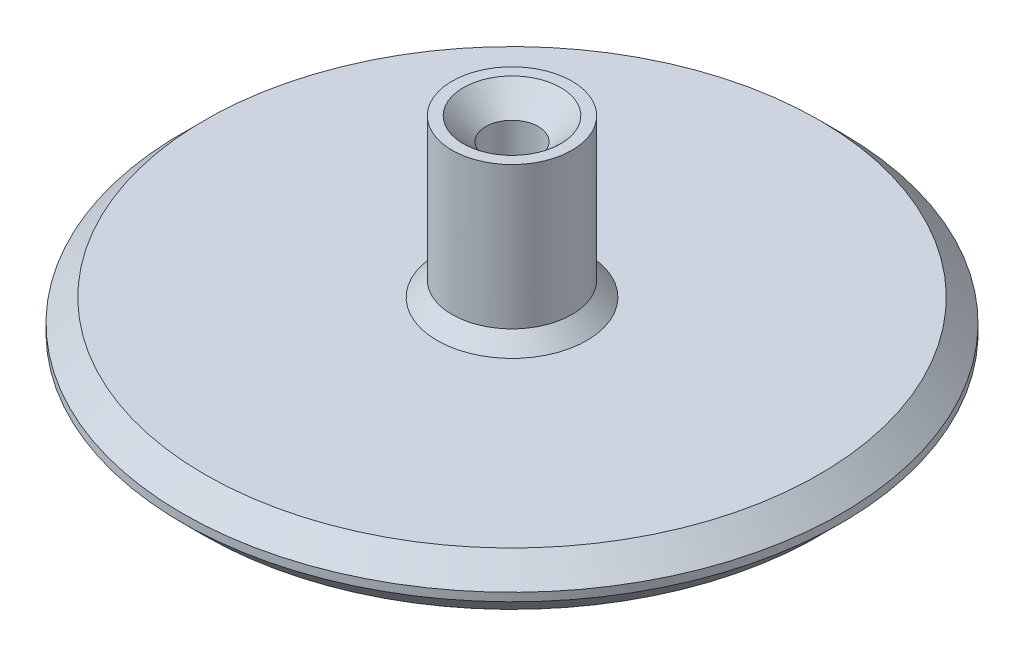
ISO-10303-21;
HEADER;
FILE_DESCRIPTION(('STEP AP214'),'2;1');
FILE_NAME('part.step','',(''),(''),'','','');
FILE_SCHEMA(('AUTOMOTIVE_DESIGN { 1 0 10303 214 1 1 1 1 }'));
ENDSEC;
DATA;
#1=APPLICATION_CONTEXT('core data for automotive mechanical design processes');
#2=APPLICATION_PROTOCOL_DEFINITION('international standard','automotive_design',2000,#1);
#3=PRODUCT_CONTEXT('',#1,'mechanical');
#4=PRODUCT('Part','Part','',(#3));
#5=PRODUCT_RELATED_PRODUCT_CATEGORY('part','',(#4));
#6=PRODUCT_DEFINITION_FORMATION('','',#4);
#7=PRODUCT_DEFINITION_CONTEXT('part definition',#1,'design');
#8=PRODUCT_DEFINITION('design','',#6,#7);
#9=PRODUCT_DEFINITION_SHAPE('','',#8);
#10=(LENGTH_UNIT() NAMED_UNIT(*) SI_UNIT(.MILLI.,.METRE.));
#11=(NAMED_UNIT(*) PLANE_ANGLE_UNIT() SI_UNIT($,.RADIAN.));
#12=(NAMED_UNIT(*) SI_UNIT($,.STERADIAN.) SOLID_ANGLE_UNIT());
#13=UNCERTAINTY_MEASURE_WITH_UNIT(LENGTH_MEASURE(1.E-05),#10,'distance_accuracy_value','');
#14=(GEOMETRIC_REPRESENTATION_CONTEXT(3) GLOBAL_UNCERTAINTY_ASSIGNED_CONTEXT((#13)) GLOBAL_UNIT_ASSIGNED_CONTEXT((#10,
#11,#12)) REPRESENTATION_CONTEXT('',''));
#15=CARTESIAN_POINT('',(0.,0.,0.));
#16=DIRECTION('',(0.,0.,1.));
#17=DIRECTION('',(1.,0.,0.));
#18=AXIS2_PLACEMENT_3D('',#15,#16,#17);
#19=CARTESIAN_POINT('',(0.,0.,0.));
#20=DIRECTION('',(0.,-1.,0.));
#21=DIRECTION('',(0.,0.,-1.));
#22=AXIS2_PLACEMENT_3D('',#19,#20,#21);
#23=CYLINDRICAL_SURFACE('',#22,1.75);
#24=CARTESIAN_POINT('',(0.,12.55,0.));
#25=DIRECTION('',(0.,-1.,0.));
#26=DIRECTION('',(0.,0.,-1.));
#27=AXIS2_PLACEMENT_3D('',#24,#25,#26);
#28=CIRCLE('',#27,1.75);
#29=CARTESIAN_POINT('',(0.,12.55,-1.75));
#30=VERTEX_POINT('',#29);
#31=EDGE_CURVE('E57',#30,#30,#28,.F.);
#32=ORIENTED_EDGE('',*,*,#31,.T.);
#33=EDGE_LOOP('',(#32));
#34=FACE_BOUND('',#33,.T.);
#35=CARTESIAN_POINT('',(0.,2.05,0.));
#36=DIRECTION('',(0.,-1.,0.));
#37=DIRECTION('',(0.,0.,-1.));
#38=AXIS2_PLACEMENT_3D('',#35,#36,#37);
#39=CIRCLE('',#38,1.75);
#40=CARTESIAN_POINT('',(0.,2.05,-1.75));
#41=VERTEX_POINT('',#40);
#42=EDGE_CURVE('E97',#41,#41,#39,.T.);
#43=ORIENTED_EDGE('',*,*,#42,.T.);
#44=EDGE_LOOP('',(#43));
#45=FACE_BOUND('',#44,.T.);
#46=ADVANCED_FACE('F42',(#34,#45),#23,.F.);
#47=CARTESIAN_POINT('',(0.,14.05,0.));
#48=DIRECTION('',(0.,-1.,0.));
#49=DIRECTION('',(0.,0.,-1.));
#50=AXIS2_PLACEMENT_3D('',#47,#48,#49);
#51=PLANE('',#50);
#52=CARTESIAN_POINT('',(0.,14.05,0.));
#53=DIRECTION('',(0.,-1.,0.));
#54=DIRECTION('',(0.,0.,-1.));
#55=AXIS2_PLACEMENT_3D('',#52,#53,#54);
#56=CIRCLE('',#55,3.25000000000001);
#57=CARTESIAN_POINT('',(0.,14.05,-3.25000000000001));
#58=VERTEX_POINT('',#57);
#59=EDGE_CURVE('E63',#58,#58,#56,.T.);
#60=ORIENTED_EDGE('',*,*,#59,.T.);
#61=EDGE_LOOP('',(#60));
#62=FACE_BOUND('',#61,.T.);
#63=CARTESIAN_POINT('',(0.,14.05,0.));
#64=DIRECTION('',(0.,-1.,0.));
#65=DIRECTION('',(0.,0.,-1.));
#66=AXIS2_PLACEMENT_3D('',#63,#64,#65);
#67=CIRCLE('',#66,4.);
#68=CARTESIAN_POINT('',(0.,14.05,-4.));
#69=VERTEX_POINT('',#68);
#70=EDGE_CURVE('E85',#69,#69,#67,.T.);
#71=ORIENTED_EDGE('',*,*,#70,.F.);
#72=EDGE_LOOP('',(#71));
#73=FACE_BOUND('',#72,.T.);
#74=ADVANCED_FACE('F128',(#62,#73),#51,.F.);
#75=CARTESIAN_POINT('',(0.,0.,0.));
#76=DIRECTION('',(0.,-1.,0.));
#77=DIRECTION('',(0.,0.,-1.));
#78=AXIS2_PLACEMENT_3D('',#75,#76,#77);
#79=CYLINDRICAL_SURFACE('',#78,4.);
#80=CARTESIAN_POINT('',(0.,4.55,0.));
#81=DIRECTION('',(0.,1.,0.));
#82=DIRECTION('',(0.,0.,1.));
#83=AXIS2_PLACEMENT_3D('',#80,#81,#82);
#84=CIRCLE('',#83,4.);
#85=CARTESIAN_POINT('',(0.,4.55,4.));
#86=VERTEX_POINT('',#85);
#87=EDGE_CURVE('E10',#86,#86,#84,.T.);
#88=ORIENTED_EDGE('',*,*,#87,.T.);
#89=EDGE_LOOP('',(#88));
#90=FACE_BOUND('',#89,.T.);
#91=ORIENTED_EDGE('',*,*,#70,.T.);
#92=EDGE_LOOP('',(#91));
#93=FACE_BOUND('',#92,.T.);
#94=ADVANCED_FACE('F134',(#90,#93),#79,.T.);
#95=CARTESIAN_POINT('',(0.,3.55,0.));
#96=DIRECTION('',(0.,1.,0.));
#97=DIRECTION('',(0.,0.,1.));
#98=AXIS2_PLACEMENT_3D('',#95,#96,#97);
#99=PLANE('',#98);
#100=CARTESIAN_POINT('',(0.,3.55,0.));
#101=DIRECTION('',(0.,1.,0.));
#102=DIRECTION('',(0.,0.,1.));
#103=AXIS2_PLACEMENT_3D('',#100,#101,#102);
#104=CIRCLE('',#103,5.);
#105=CARTESIAN_POINT('',(0.,3.55,5.));
#106=VERTEX_POINT('',#105);
#107=EDGE_CURVE('E51',#106,#106,#104,.F.);
#108=ORIENTED_EDGE('',*,*,#107,.T.);
#109=EDGE_LOOP('',(#108));
#110=FACE_BOUND('',#109,.T.);
#111=CARTESIAN_POINT('',(0.,3.55,0.));
#112=DIRECTION('',(0.,1.,0.));
#113=DIRECTION('',(0.,0.,1.));
#114=AXIS2_PLACEMENT_3D('',#111,#112,#113);
#115=CIRCLE('',#114,20.5);
#116=CARTESIAN_POINT('',(0.,3.55,20.5));
#117=VERTEX_POINT('',#116);
#118=EDGE_CURVE('E73',#117,#117,#115,.T.);
#119=ORIENTED_EDGE('',*,*,#118,.T.);
#120=EDGE_LOOP('',(#119));
#121=FACE_BOUND('',#120,.T.);
#122=ADVANCED_FACE('F168',(#110,#121),#99,.T.);
#123=CARTESIAN_POINT('',(0.,0.,0.));
#124=DIRECTION('',(0.,-1.,0.));
#125=DIRECTION('',(0.,0.,-1.));
#126=AXIS2_PLACEMENT_3D('',#123,#124,#125);
#127=CYLINDRICAL_SURFACE('',#126,22.);
#128=CARTESIAN_POINT('',(0.,2.04999999999999,0.));
#129=DIRECTION('',(0.,1.,0.));
#130=DIRECTION('',(0.,0.,1.));
#131=AXIS2_PLACEMENT_3D('',#128,#129,#130);
#132=CIRCLE('',#131,22.);
#133=CARTESIAN_POINT('',(0.,2.04999999999999,22.));
#134=VERTEX_POINT('',#133);
#135=EDGE_CURVE('E77',#134,#134,#132,.F.);
#136=ORIENTED_EDGE('',*,*,#135,.T.);
#137=EDGE_LOOP('',(#136));
#138=FACE_BOUND('',#137,.T.);
#139=CARTESIAN_POINT('',(0.,1.49999999999998,0.));
#140=DIRECTION('',(0.,-1.,0.));
#141=DIRECTION('',(0.,0.,-1.));
#142=AXIS2_PLACEMENT_3D('',#139,#140,#141);
#143=CIRCLE('',#142,22.);
#144=CARTESIAN_POINT('',(0.,1.49999999999998,-22.));
#145=VERTEX_POINT('',#144);
#146=EDGE_CURVE('E81',#145,#145,#143,.F.);
#147=ORIENTED_EDGE('',*,*,#146,.T.);
#148=EDGE_LOOP('',(#147));
#149=FACE_BOUND('',#148,.T.);
#150=ADVANCED_FACE('F124',(#138,#149),#127,.T.);
#151=CARTESIAN_POINT('',(0.,0.,0.));
#152=DIRECTION('',(0.,-1.,0.));
#153=DIRECTION('',(0.,0.,-1.));
#154=AXIS2_PLACEMENT_3D('',#151,#152,#153);
#155=PLANE('',#154);
#156=CARTESIAN_POINT('',(0.,0.,0.));
#157=DIRECTION('',(0.,-1.,0.));
#158=DIRECTION('',(0.,0.,-1.));
#159=AXIS2_PLACEMENT_3D('',#156,#157,#158);
#160=CIRCLE('',#159,20.5);
#161=CARTESIAN_POINT('',(0.,0.,-20.5));
#162=VERTEX_POINT('',#161);
#163=EDGE_CURVE('E69',#162,#162,#160,.T.);
#164=ORIENTED_EDGE('',*,*,#163,.T.);
#165=EDGE_LOOP('',(#164));
#166=FACE_BOUND('',#165,.T.);
#167=ADVANCED_FACE('F119',(#166),#155,.T.);
#168=CARTESIAN_POINT('',(0.,1.5,0.));
#169=DIRECTION('',(0.,-1.,0.));
#170=DIRECTION('',(0.,0.,-1.));
#171=AXIS2_PLACEMENT_3D('',#168,#169,#170);
#172=PLANE('',#171);
#173=CARTESIAN_POINT('',(0.,1.5,0.));
#174=DIRECTION('',(0.,-1.,0.));
#175=DIRECTION('',(0.,0.,-1.));
#176=AXIS2_PLACEMENT_3D('',#173,#174,#175);
#177=CIRCLE('',#176,20.);
#178=CARTESIAN_POINT('',(0.,1.5,-20.));
#179=VERTEX_POINT('',#178);
#180=EDGE_CURVE('E89',#179,#179,#177,.T.);
#181=ORIENTED_EDGE('',*,*,#180,.F.);
#182=EDGE_LOOP('',(#181));
#183=FACE_BOUND('',#182,.T.);
#184=ADVANCED_FACE('F114',(#183),#172,.F.);
#185=CARTESIAN_POINT('',(0.,0.,0.));
#186=DIRECTION('',(0.,-1.,0.));
#187=DIRECTION('',(0.,0.,-1.));
#188=AXIS2_PLACEMENT_3D('',#185,#186,#187);
#189=CYLINDRICAL_SURFACE('',#188,20.);
#190=CARTESIAN_POINT('',(0.,2.05,0.));
#191=DIRECTION('',(0.,-1.,0.));
#192=DIRECTION('',(0.,0.,-1.));
#193=AXIS2_PLACEMENT_3D('',#190,#191,#192);
#194=CIRCLE('',#193,20.);
#195=CARTESIAN_POINT('',(0.,2.05,-20.));
#196=VERTEX_POINT('',#195);
#197=EDGE_CURVE('E93',#196,#196,#194,.T.);
#198=ORIENTED_EDGE('',*,*,#197,.F.);
#199=EDGE_LOOP('',(#198));
#200=FACE_BOUND('',#199,.T.);
#201=ORIENTED_EDGE('',*,*,#180,.T.);
#202=EDGE_LOOP('',(#201));
#203=FACE_BOUND('',#202,.T.);
#204=ADVANCED_FACE('F108',(#200,#203),#189,.F.);
#205=CARTESIAN_POINT('',(0.,2.05,0.));
#206=DIRECTION('',(0.,1.,0.));
#207=DIRECTION('',(0.,0.,1.));
#208=AXIS2_PLACEMENT_3D('',#205,#206,#207);
#209=PLANE('',#208);
#210=ORIENTED_EDGE('',*,*,#42,.F.);
#211=EDGE_LOOP('',(#210));
#212=FACE_BOUND('',#211,.T.);
#213=ORIENTED_EDGE('',*,*,#197,.T.);
#214=EDGE_LOOP('',(#213));
#215=FACE_BOUND('',#214,.T.);
#216=ADVANCED_FACE('F104',(#212,#215),#209,.F.);
#217=CARTESIAN_POINT('',(0.,2.04999999999999,0.));
#218=DIRECTION('',(0.,-1.,0.));
#219=DIRECTION('',(0.,0.,-1.));
#220=AXIS2_PLACEMENT_3D('',#217,#218,#219);
#221=CONICAL_SURFACE('',#220,22.,0.785398163397451);
#222=ORIENTED_EDGE('',*,*,#118,.F.);
#223=EDGE_LOOP('',(#222));
#224=FACE_BOUND('',#223,.T.);
#225=ORIENTED_EDGE('',*,*,#135,.F.);
#226=EDGE_LOOP('',(#225));
#227=FACE_BOUND('',#226,.T.);
#228=ADVANCED_FACE('F107',(#224,#227),#221,.T.);
#229=CARTESIAN_POINT('',(0.,0.,0.));
#230=DIRECTION('',(0.,1.,0.));
#231=DIRECTION('',(0.,0.,1.));
#232=AXIS2_PLACEMENT_3D('',#229,#230,#231);
#233=CONICAL_SURFACE('',#232,20.5,0.785398163397448);
#234=ORIENTED_EDGE('',*,*,#146,.F.);
#235=EDGE_LOOP('',(#234));
#236=FACE_BOUND('',#235,.T.);
#237=ORIENTED_EDGE('',*,*,#163,.F.);
#238=EDGE_LOOP('',(#237));
#239=FACE_BOUND('',#238,.T.);
#240=ADVANCED_FACE('F145',(#236,#239),#233,.T.);
#241=CARTESIAN_POINT('',(0.,14.05,0.));
#242=DIRECTION('',(0.,1.,0.));
#243=DIRECTION('',(0.,0.,1.));
#244=AXIS2_PLACEMENT_3D('',#241,#242,#243);
#245=CONICAL_SURFACE('',#244,3.25000000000001,0.785398163397445);
#246=ORIENTED_EDGE('',*,*,#31,.F.);
#247=EDGE_LOOP('',(#246));
#248=FACE_BOUND('',#247,.T.);
#249=ORIENTED_EDGE('',*,*,#59,.F.);
#250=EDGE_LOOP('',(#249));
#251=FACE_BOUND('',#250,.T.);
#252=ADVANCED_FACE('F151',(#248,#251),#245,.F.);
#253=CARTESIAN_POINT('',(0.,3.55,0.));
#254=DIRECTION('',(0.,-1.,0.));
#255=DIRECTION('',(0.,0.,-1.));
#256=AXIS2_PLACEMENT_3D('',#253,#254,#255);
#257=CONICAL_SURFACE('',#256,5.,0.785398163397448);
#258=ORIENTED_EDGE('',*,*,#87,.F.);
#259=EDGE_LOOP('',(#258));
#260=FACE_BOUND('',#259,.T.);
#261=ORIENTED_EDGE('',*,*,#107,.F.);
#262=EDGE_LOOP('',(#261));
#263=FACE_BOUND('',#262,.T.);
#264=ADVANCED_FACE('F45',(#260,#263),#257,.T.);
#265=CLOSED_SHELL('',(#46,#74,#94,#122,#150,#167,#184,#204,#216,#228,#240,#252,#264));
#266=MANIFOLD_SOLID_BREP('B2',#265);
#267=ADVANCED_BREP_SHAPE_REPRESENTATION('',(#18,#266),#14);
#268=SHAPE_DEFINITION_REPRESENTATION(#9,#267);
ENDSEC;
END-ISO-10303-21;
